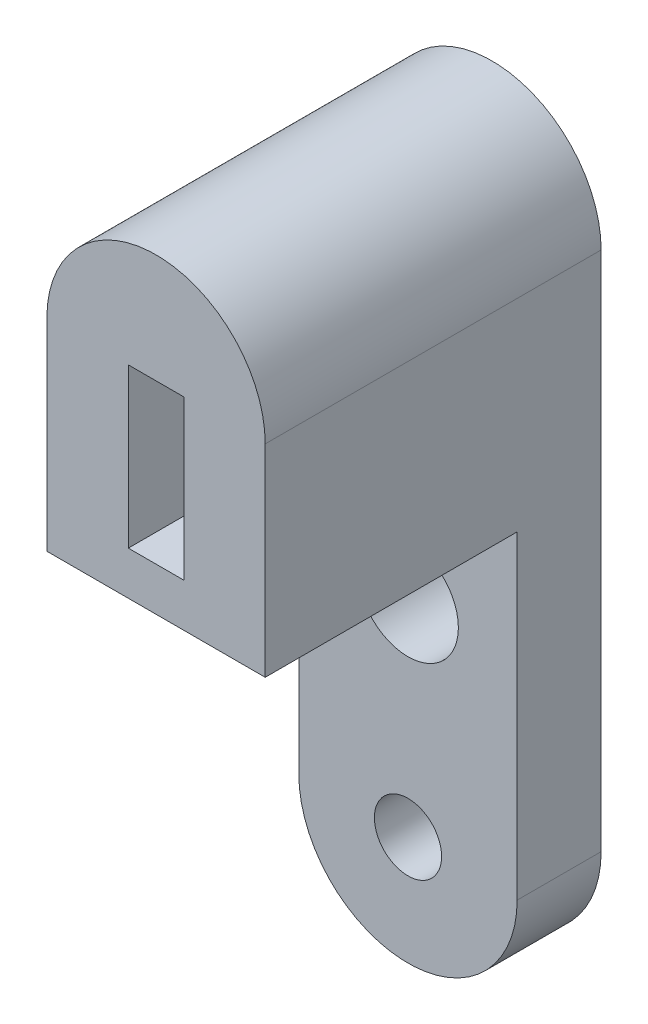
ISO-10303-21;
HEADER;
FILE_DESCRIPTION(('STEP AP214'),'2;1');
FILE_NAME('part.step','',(''),(''),'','','');
FILE_SCHEMA(('AUTOMOTIVE_DESIGN { 1 0 10303 214 1 1 1 1 }'));
ENDSEC;
DATA;
#1=APPLICATION_CONTEXT('core data for automotive mechanical design processes');
#2=APPLICATION_PROTOCOL_DEFINITION('international standard','automotive_design',2000,#1);
#3=PRODUCT_CONTEXT('',#1,'mechanical');
#4=PRODUCT('Part','Part','',(#3));
#5=PRODUCT_RELATED_PRODUCT_CATEGORY('part','',(#4));
#6=PRODUCT_DEFINITION_FORMATION('','',#4);
#7=PRODUCT_DEFINITION_CONTEXT('part definition',#1,'design');
#8=PRODUCT_DEFINITION('design','',#6,#7);
#9=PRODUCT_DEFINITION_SHAPE('','',#8);
#10=(LENGTH_UNIT() NAMED_UNIT(*) SI_UNIT(.MILLI.,.METRE.));
#11=(NAMED_UNIT(*) PLANE_ANGLE_UNIT() SI_UNIT($,.RADIAN.));
#12=(NAMED_UNIT(*) SI_UNIT($,.STERADIAN.) SOLID_ANGLE_UNIT());
#13=UNCERTAINTY_MEASURE_WITH_UNIT(LENGTH_MEASURE(1.E-05),#10,'distance_accuracy_value','');
#14=(GEOMETRIC_REPRESENTATION_CONTEXT(3) GLOBAL_UNCERTAINTY_ASSIGNED_CONTEXT((#13)) GLOBAL_UNIT_ASSIGNED_CONTEXT((#10,
#11,#12)) REPRESENTATION_CONTEXT('',''));
#15=CARTESIAN_POINT('',(0.,0.,0.));
#16=DIRECTION('',(0.,0.,1.));
#17=DIRECTION('',(1.,0.,0.));
#18=AXIS2_PLACEMENT_3D('',#15,#16,#17);
#19=CARTESIAN_POINT('',(0.,0.,5.));
#20=DIRECTION('',(0.,0.,1.));
#21=DIRECTION('',(1.,0.,0.));
#22=AXIS2_PLACEMENT_3D('',#19,#20,#21);
#23=PLANE('',#22);
#24=CARTESIAN_POINT('',(0.,-17.7120700798321,5.));
#25=DIRECTION('',(0.,0.,1.));
#26=DIRECTION('',(1.,0.,0.));
#27=AXIS2_PLACEMENT_3D('',#24,#25,#26);
#28=CIRCLE('',#27,2.);
#29=CARTESIAN_POINT('',(2.,-17.7120700798321,5.));
#30=VERTEX_POINT('',#29);
#31=EDGE_CURVE('E242',#30,#30,#28,.T.);
#32=ORIENTED_EDGE('',*,*,#31,.F.);
#33=EDGE_LOOP('',(#32));
#34=FACE_BOUND('',#33,.T.);
#35=CARTESIAN_POINT('',(0.,-5.41207007983211,5.));
#36=DIRECTION('',(0.,0.,1.));
#37=DIRECTION('',(1.,0.,0.));
#38=AXIS2_PLACEMENT_3D('',#35,#36,#37);
#39=CIRCLE('',#38,2.99999999999997);
#40=CARTESIAN_POINT('',(2.99999999999997,-5.41207007983211,5.));
#41=VERTEX_POINT('',#40);
#42=EDGE_CURVE('E239',#41,#41,#39,.T.);
#43=ORIENTED_EDGE('',*,*,#42,.F.);
#44=EDGE_LOOP('',(#43));
#45=FACE_BOUND('',#44,.T.);
#46=DIRECTION('',(0.,1.,0.));
#47=VECTOR('',#46,1.);
#48=CARTESIAN_POINT('',(6.5,0.,5.));
#49=LINE('',#48,#47);
#50=CARTESIAN_POINT('',(6.5,-17.7120700798321,5.));
#51=VERTEX_POINT('',#50);
#52=CARTESIAN_POINT('',(6.5,1.27632568742796,5.));
#53=VERTEX_POINT('',#52);
#54=EDGE_CURVE('E252',#51,#53,#49,.T.);
#55=ORIENTED_EDGE('',*,*,#54,.T.);
#56=DIRECTION('',(-1.,0.,0.));
#57=VECTOR('',#56,1.);
#58=CARTESIAN_POINT('',(0.,1.27632568742796,5.));
#59=LINE('',#58,#57);
#60=CARTESIAN_POINT('',(-6.5,1.27632568742796,5.));
#61=VERTEX_POINT('',#60);
#62=EDGE_CURVE('E236',#53,#61,#59,.T.);
#63=ORIENTED_EDGE('',*,*,#62,.T.);
#64=DIRECTION('',(0.,1.,0.));
#65=VECTOR('',#64,1.);
#66=CARTESIAN_POINT('',(-6.5,0.,5.));
#67=LINE('',#66,#65);
#68=CARTESIAN_POINT('',(-6.5,-17.7120700798321,5.));
#69=VERTEX_POINT('',#68);
#70=EDGE_CURVE('E246',#69,#61,#67,.T.);
#71=ORIENTED_EDGE('',*,*,#70,.F.);
#72=CARTESIAN_POINT('',(0.,-17.7120700798321,5.));
#73=DIRECTION('',(0.,0.,1.));
#74=DIRECTION('',(1.,0.,0.));
#75=AXIS2_PLACEMENT_3D('',#72,#73,#74);
#76=CIRCLE('',#75,6.5);
#77=EDGE_CURVE('E249',#69,#51,#76,.T.);
#78=ORIENTED_EDGE('',*,*,#77,.T.);
#79=EDGE_LOOP('',(#55,#63,#71,#78));
#80=FACE_BOUND('',#79,.T.);
#81=ADVANCED_FACE('F37',(#34,#45,#80),#23,.T.);
#82=CARTESIAN_POINT('',(1.65,0.,5.));
#83=DIRECTION('',(-1.,0.,0.));
#84=DIRECTION('',(0.,-1.,0.));
#85=AXIS2_PLACEMENT_3D('',#82,#83,#84);
#86=PLANE('',#85);
#87=DIRECTION('',(0.,1.,0.));
#88=VECTOR('',#87,1.);
#89=CARTESIAN_POINT('',(1.65,0.,0.));
#90=LINE('',#89,#88);
#91=CARTESIAN_POINT('',(1.65,3.86292992016788,0.));
#92=VERTEX_POINT('',#91);
#93=CARTESIAN_POINT('',(1.65,13.3129299201679,0.));
#94=VERTEX_POINT('',#93);
#95=EDGE_CURVE('E271',#92,#94,#90,.T.);
#96=ORIENTED_EDGE('',*,*,#95,.F.);
#97=DIRECTION('',(0.,0.,-1.));
#98=VECTOR('',#97,1.);
#99=CARTESIAN_POINT('',(1.65,3.86292992016788,5.));
#100=LINE('',#99,#98);
#101=CARTESIAN_POINT('',(1.65,3.86292992016788,20.));
#102=VERTEX_POINT('',#101);
#103=EDGE_CURVE('E11',#102,#92,#100,.T.);
#104=ORIENTED_EDGE('',*,*,#103,.F.);
#105=DIRECTION('',(0.,1.,0.));
#106=VECTOR('',#105,1.);
#107=CARTESIAN_POINT('',(1.65,0.,20.));
#108=LINE('',#107,#106);
#109=CARTESIAN_POINT('',(1.65,13.3129299201679,20.));
#110=VERTEX_POINT('',#109);
#111=EDGE_CURVE('E202',#102,#110,#108,.T.);
#112=ORIENTED_EDGE('',*,*,#111,.T.);
#113=DIRECTION('',(0.,0.,-1.));
#114=VECTOR('',#113,1.);
#115=CARTESIAN_POINT('',(1.65,13.3129299201679,5.));
#116=LINE('',#115,#114);
#117=EDGE_CURVE('E282',#110,#94,#116,.T.);
#118=ORIENTED_EDGE('',*,*,#117,.T.);
#119=EDGE_LOOP('',(#96,#104,#112,#118));
#120=FACE_BOUND('',#119,.T.);
#121=ADVANCED_FACE('F320',(#120),#86,.T.);
#122=CARTESIAN_POINT('',(0.,3.86292992016788,5.));
#123=DIRECTION('',(0.,1.,0.));
#124=DIRECTION('',(0.,0.,1.));
#125=AXIS2_PLACEMENT_3D('',#122,#123,#124);
#126=PLANE('',#125);
#127=DIRECTION('',(1.,0.,0.));
#128=VECTOR('',#127,1.);
#129=CARTESIAN_POINT('',(0.,3.86292992016788,0.));
#130=LINE('',#129,#128);
#131=CARTESIAN_POINT('',(-1.65,3.86292992016788,0.));
#132=VERTEX_POINT('',#131);
#133=EDGE_CURVE('E274',#132,#92,#130,.T.);
#134=ORIENTED_EDGE('',*,*,#133,.F.);
#135=DIRECTION('',(0.,0.,-1.));
#136=VECTOR('',#135,1.);
#137=CARTESIAN_POINT('',(-1.65,3.86292992016788,5.));
#138=LINE('',#137,#136);
#139=CARTESIAN_POINT('',(-1.65,3.86292992016788,20.));
#140=VERTEX_POINT('',#139);
#141=EDGE_CURVE('E46',#140,#132,#138,.T.);
#142=ORIENTED_EDGE('',*,*,#141,.F.);
#143=DIRECTION('',(1.,0.,0.));
#144=VECTOR('',#143,1.);
#145=CARTESIAN_POINT('',(0.,3.86292992016788,20.));
#146=LINE('',#145,#144);
#147=EDGE_CURVE('E212',#140,#102,#146,.T.);
#148=ORIENTED_EDGE('',*,*,#147,.T.);
#149=ORIENTED_EDGE('',*,*,#103,.T.);
#150=EDGE_LOOP('',(#134,#142,#148,#149));
#151=FACE_BOUND('',#150,.T.);
#152=ADVANCED_FACE('F326',(#151),#126,.T.);
#153=CARTESIAN_POINT('',(-1.65,0.,5.));
#154=DIRECTION('',(-1.,0.,0.));
#155=DIRECTION('',(0.,-1.,0.));
#156=AXIS2_PLACEMENT_3D('',#153,#154,#155);
#157=PLANE('',#156);
#158=CARTESIAN_POINT('',(-1.65,8.58792992016788,10.));
#159=DIRECTION('',(-1.,0.,0.));
#160=DIRECTION('',(0.,-1.,0.));
#161=AXIS2_PLACEMENT_3D('',#158,#159,#160);
#162=CIRCLE('',#161,2.38125);
#163=CARTESIAN_POINT('',(-1.65,6.20667992016788,10.));
#164=VERTEX_POINT('',#163);
#165=EDGE_CURVE('E190',#164,#164,#162,.F.);
#166=ORIENTED_EDGE('',*,*,#165,.F.);
#167=EDGE_LOOP('',(#166));
#168=FACE_BOUND('',#167,.T.);
#169=DIRECTION('',(0.,1.,0.));
#170=VECTOR('',#169,1.);
#171=CARTESIAN_POINT('',(-1.65,0.,0.));
#172=LINE('',#171,#170);
#173=CARTESIAN_POINT('',(-1.65,13.3129299201679,0.));
#174=VERTEX_POINT('',#173);
#175=EDGE_CURVE('E277',#132,#174,#172,.T.);
#176=ORIENTED_EDGE('',*,*,#175,.T.);
#177=DIRECTION('',(0.,0.,-1.));
#178=VECTOR('',#177,1.);
#179=CARTESIAN_POINT('',(-1.65,13.3129299201679,5.));
#180=LINE('',#179,#178);
#181=CARTESIAN_POINT('',(-1.65,13.3129299201679,20.));
#182=VERTEX_POINT('',#181);
#183=EDGE_CURVE('E284',#182,#174,#180,.T.);
#184=ORIENTED_EDGE('',*,*,#183,.F.);
#185=DIRECTION('',(0.,1.,0.));
#186=VECTOR('',#185,1.);
#187=CARTESIAN_POINT('',(-1.65,0.,20.));
#188=LINE('',#187,#186);
#189=EDGE_CURVE('E215',#140,#182,#188,.T.);
#190=ORIENTED_EDGE('',*,*,#189,.F.);
#191=ORIENTED_EDGE('',*,*,#141,.T.);
#192=EDGE_LOOP('',(#176,#184,#190,#191));
#193=FACE_BOUND('',#192,.T.);
#194=ADVANCED_FACE('F340',(#168,#193),#157,.F.);
#195=CARTESIAN_POINT('',(-6.5,0.,5.));
#196=DIRECTION('',(-1.,0.,0.));
#197=DIRECTION('',(0.,0.,1.));
#198=AXIS2_PLACEMENT_3D('',#195,#196,#197);
#199=PLANE('',#198);
#200=DIRECTION('',(0.,0.,1.));
#201=VECTOR('',#200,1.);
#202=CARTESIAN_POINT('',(-6.5,4.46042992016789,7.61698676391981));
#203=LINE('',#202,#201);
#204=CARTESIAN_POINT('',(-6.5,4.46042992016789,7.61698676391981));
#205=VERTEX_POINT('',#204);
#206=CARTESIAN_POINT('',(-6.5,4.46042992016789,12.3830132360802));
#207=VERTEX_POINT('',#206);
#208=EDGE_CURVE('E54',#205,#207,#203,.T.);
#209=ORIENTED_EDGE('',*,*,#208,.F.);
#210=DIRECTION('',(0.,-0.866025403784439,0.5));
#211=VECTOR('',#210,1.);
#212=CARTESIAN_POINT('',(-6.5,8.58792992016789,5.23397352783963));
#213=LINE('',#212,#211);
#214=CARTESIAN_POINT('',(-6.5,8.58792992016789,5.23397352783963));
#215=VERTEX_POINT('',#214);
#216=EDGE_CURVE('E172',#215,#205,#213,.T.);
#217=ORIENTED_EDGE('',*,*,#216,.F.);
#218=DIRECTION('',(0.,-0.866025403784439,-0.5));
#219=VECTOR('',#218,1.);
#220=CARTESIAN_POINT('',(-6.5,12.7154299201679,7.61698676391982));
#221=LINE('',#220,#219);
#222=CARTESIAN_POINT('',(-6.5,12.7154299201679,7.61698676391982));
#223=VERTEX_POINT('',#222);
#224=EDGE_CURVE('E175',#223,#215,#221,.T.);
#225=ORIENTED_EDGE('',*,*,#224,.F.);
#226=DIRECTION('',(0.,0.,-1.));
#227=VECTOR('',#226,1.);
#228=CARTESIAN_POINT('',(-6.5,12.7154299201679,12.3830132360802));
#229=LINE('',#228,#227);
#230=CARTESIAN_POINT('',(-6.5,12.7154299201679,12.3830132360802));
#231=VERTEX_POINT('',#230);
#232=EDGE_CURVE('E195',#231,#223,#229,.T.);
#233=ORIENTED_EDGE('',*,*,#232,.F.);
#234=DIRECTION('',(0.,0.866025403784439,-0.5));
#235=VECTOR('',#234,1.);
#236=CARTESIAN_POINT('',(-6.5,8.58792992016789,14.7660264721604));
#237=LINE('',#236,#235);
#238=CARTESIAN_POINT('',(-6.5,8.58792992016789,14.7660264721604));
#239=VERTEX_POINT('',#238);
#240=EDGE_CURVE('E192',#239,#231,#237,.T.);
#241=ORIENTED_EDGE('',*,*,#240,.F.);
#242=DIRECTION('',(0.,0.866025403784439,0.499999999999999));
#243=VECTOR('',#242,1.);
#244=CARTESIAN_POINT('',(-6.5,4.46042992016789,12.3830132360802));
#245=LINE('',#244,#243);
#246=EDGE_CURVE('E189',#207,#239,#245,.T.);
#247=ORIENTED_EDGE('',*,*,#246,.F.);
#248=EDGE_LOOP('',(#209,#217,#225,#233,#241,#247));
#249=FACE_BOUND('',#248,.T.);
#250=DIRECTION('',(0.,0.,-1.));
#251=VECTOR('',#250,1.);
#252=CARTESIAN_POINT('',(-6.5,13.3129299201679,5.));
#253=LINE('',#252,#251);
#254=CARTESIAN_POINT('',(-6.5,13.3129299201679,20.));
#255=VERTEX_POINT('',#254);
#256=CARTESIAN_POINT('',(-6.5,13.3129299201679,0.));
#257=VERTEX_POINT('',#256);
#258=EDGE_CURVE('E255',#255,#257,#253,.T.);
#259=ORIENTED_EDGE('',*,*,#258,.T.);
#260=DIRECTION('',(0.,1.,0.));
#261=VECTOR('',#260,1.);
#262=CARTESIAN_POINT('',(-6.5,0.,0.));
#263=LINE('',#262,#261);
#264=CARTESIAN_POINT('',(-6.5,-17.7120700798321,0.));
#265=VERTEX_POINT('',#264);
#266=EDGE_CURVE('E261',#265,#257,#263,.T.);
#267=ORIENTED_EDGE('',*,*,#266,.F.);
#268=DIRECTION('',(0.,0.,-1.));
#269=VECTOR('',#268,1.);
#270=CARTESIAN_POINT('',(-6.5,-17.7120700798321,5.));
#271=LINE('',#270,#269);
#272=EDGE_CURVE('E41',#69,#265,#271,.T.);
#273=ORIENTED_EDGE('',*,*,#272,.F.);
#274=ORIENTED_EDGE('',*,*,#70,.T.);
#275=DIRECTION('',(0.,0.,-1.));
#276=VECTOR('',#275,1.);
#277=CARTESIAN_POINT('',(-6.5,1.27632568742796,20.));
#278=LINE('',#277,#276);
#279=CARTESIAN_POINT('',(-6.5,1.27632568742796,20.));
#280=VERTEX_POINT('',#279);
#281=EDGE_CURVE('E62',#280,#61,#278,.T.);
#282=ORIENTED_EDGE('',*,*,#281,.F.);
#283=DIRECTION('',(0.,1.,0.));
#284=VECTOR('',#283,1.);
#285=CARTESIAN_POINT('',(-6.5,0.,20.));
#286=LINE('',#285,#284);
#287=EDGE_CURVE('E227',#280,#255,#286,.T.);
#288=ORIENTED_EDGE('',*,*,#287,.T.);
#289=EDGE_LOOP('',(#259,#267,#273,#274,#282,#288));
#290=FACE_BOUND('',#289,.T.);
#291=ADVANCED_FACE('F307',(#249,#290),#199,.T.);
#292=CARTESIAN_POINT('',(0.,-17.7120700798321,5.));
#293=DIRECTION('',(0.,0.,-1.));
#294=DIRECTION('',(-1.,0.,0.));
#295=AXIS2_PLACEMENT_3D('',#292,#293,#294);
#296=CYLINDRICAL_SURFACE('',#295,6.5);
#297=CARTESIAN_POINT('',(0.,-17.7120700798321,0.));
#298=DIRECTION('',(0.,0.,1.));
#299=DIRECTION('',(1.,0.,0.));
#300=AXIS2_PLACEMENT_3D('',#297,#298,#299);
#301=CIRCLE('',#300,6.5);
#302=CARTESIAN_POINT('',(6.5,-17.7120700798321,0.));
#303=VERTEX_POINT('',#302);
#304=EDGE_CURVE('E263',#265,#303,#301,.T.);
#305=ORIENTED_EDGE('',*,*,#304,.T.);
#306=DIRECTION('',(0.,0.,-1.));
#307=VECTOR('',#306,1.);
#308=CARTESIAN_POINT('',(6.5,-17.7120700798321,5.));
#309=LINE('',#308,#307);
#310=EDGE_CURVE('E292',#51,#303,#309,.T.);
#311=ORIENTED_EDGE('',*,*,#310,.F.);
#312=ORIENTED_EDGE('',*,*,#77,.F.);
#313=ORIENTED_EDGE('',*,*,#272,.T.);
#314=EDGE_LOOP('',(#305,#311,#312,#313));
#315=FACE_BOUND('',#314,.T.);
#316=ADVANCED_FACE('F299',(#315),#296,.T.);
#317=CARTESIAN_POINT('',(6.5,0.,5.));
#318=DIRECTION('',(-1.,0.,0.));
#319=DIRECTION('',(0.,0.,1.));
#320=AXIS2_PLACEMENT_3D('',#317,#318,#319);
#321=PLANE('',#320);
#322=DIRECTION('',(0.,0.,-1.));
#323=VECTOR('',#322,1.);
#324=CARTESIAN_POINT('',(6.5,13.3129299201679,5.));
#325=LINE('',#324,#323);
#326=CARTESIAN_POINT('',(6.5,13.3129299201679,20.));
#327=VERTEX_POINT('',#326);
#328=CARTESIAN_POINT('',(6.5,13.3129299201679,0.));
#329=VERTEX_POINT('',#328);
#330=EDGE_CURVE('E290',#327,#329,#325,.T.);
#331=ORIENTED_EDGE('',*,*,#330,.F.);
#332=DIRECTION('',(0.,1.,0.));
#333=VECTOR('',#332,1.);
#334=CARTESIAN_POINT('',(6.5,0.,20.));
#335=LINE('',#334,#333);
#336=CARTESIAN_POINT('',(6.5,1.27632568742796,20.));
#337=VERTEX_POINT('',#336);
#338=EDGE_CURVE('E221',#337,#327,#335,.T.);
#339=ORIENTED_EDGE('',*,*,#338,.F.);
#340=DIRECTION('',(0.,0.,-1.));
#341=VECTOR('',#340,1.);
#342=CARTESIAN_POINT('',(6.5,1.27632568742796,20.));
#343=LINE('',#342,#341);
#344=EDGE_CURVE('E232',#337,#53,#343,.T.);
#345=ORIENTED_EDGE('',*,*,#344,.T.);
#346=ORIENTED_EDGE('',*,*,#54,.F.);
#347=ORIENTED_EDGE('',*,*,#310,.T.);
#348=DIRECTION('',(0.,1.,0.));
#349=VECTOR('',#348,1.);
#350=CARTESIAN_POINT('',(6.5,0.,0.));
#351=LINE('',#350,#349);
#352=EDGE_CURVE('E266',#303,#329,#351,.T.);
#353=ORIENTED_EDGE('',*,*,#352,.T.);
#354=EDGE_LOOP('',(#331,#339,#345,#346,#347,#353));
#355=FACE_BOUND('',#354,.T.);
#356=ADVANCED_FACE('F313',(#355),#321,.F.);
#357=CARTESIAN_POINT('',(0.,13.3129299201679,5.));
#358=DIRECTION('',(0.,0.,-1.));
#359=DIRECTION('',(-1.,0.,0.));
#360=AXIS2_PLACEMENT_3D('',#357,#358,#359);
#361=CYLINDRICAL_SURFACE('',#360,6.5);
#362=CARTESIAN_POINT('',(0.,13.3129299201679,0.));
#363=DIRECTION('',(0.,0.,1.));
#364=DIRECTION('',(1.,0.,0.));
#365=AXIS2_PLACEMENT_3D('',#362,#363,#364);
#366=CIRCLE('',#365,6.5);
#367=EDGE_CURVE('E268',#329,#257,#366,.T.);
#368=ORIENTED_EDGE('',*,*,#367,.T.);
#369=ORIENTED_EDGE('',*,*,#258,.F.);
#370=CARTESIAN_POINT('',(0.,13.3129299201679,20.));
#371=DIRECTION('',(0.,0.,1.));
#372=DIRECTION('',(1.,0.,0.));
#373=AXIS2_PLACEMENT_3D('',#370,#371,#372);
#374=CIRCLE('',#373,6.5);
#375=EDGE_CURVE('E224',#327,#255,#374,.T.);
#376=ORIENTED_EDGE('',*,*,#375,.F.);
#377=ORIENTED_EDGE('',*,*,#330,.T.);
#378=EDGE_LOOP('',(#368,#369,#376,#377));
#379=FACE_BOUND('',#378,.T.);
#380=ADVANCED_FACE('F311',(#379),#361,.T.);
#381=CARTESIAN_POINT('',(0.,-17.7120700798321,5.));
#382=DIRECTION('',(0.,0.,-1.));
#383=DIRECTION('',(-1.,0.,0.));
#384=AXIS2_PLACEMENT_3D('',#381,#382,#383);
#385=CYLINDRICAL_SURFACE('',#384,2.);
#386=ORIENTED_EDGE('',*,*,#31,.T.);
#387=EDGE_LOOP('',(#386));
#388=FACE_BOUND('',#387,.T.);
#389=CARTESIAN_POINT('',(0.,-17.7120700798321,0.));
#390=DIRECTION('',(0.,0.,1.));
#391=DIRECTION('',(1.,0.,0.));
#392=AXIS2_PLACEMENT_3D('',#389,#390,#391);
#393=CIRCLE('',#392,2.);
#394=CARTESIAN_POINT('',(2.,-17.7120700798321,0.));
#395=VERTEX_POINT('',#394);
#396=EDGE_CURVE('E258',#395,#395,#393,.T.);
#397=ORIENTED_EDGE('',*,*,#396,.F.);
#398=EDGE_LOOP('',(#397));
#399=FACE_BOUND('',#398,.T.);
#400=ADVANCED_FACE('F349',(#388,#399),#385,.F.);
#401=CARTESIAN_POINT('',(0.,-5.41207007983211,5.));
#402=DIRECTION('',(0.,0.,-1.));
#403=DIRECTION('',(-1.,0.,0.));
#404=AXIS2_PLACEMENT_3D('',#401,#402,#403);
#405=CYLINDRICAL_SURFACE('',#404,2.99999999999997);
#406=ORIENTED_EDGE('',*,*,#42,.T.);
#407=EDGE_LOOP('',(#406));
#408=FACE_BOUND('',#407,.T.);
#409=CARTESIAN_POINT('',(0.,-5.41207007983211,0.));
#410=DIRECTION('',(0.,0.,1.));
#411=DIRECTION('',(1.,0.,0.));
#412=AXIS2_PLACEMENT_3D('',#409,#410,#411);
#413=CIRCLE('',#412,2.99999999999997);
#414=CARTESIAN_POINT('',(2.99999999999997,-5.41207007983211,0.));
#415=VERTEX_POINT('',#414);
#416=EDGE_CURVE('E238',#415,#415,#413,.T.);
#417=ORIENTED_EDGE('',*,*,#416,.F.);
#418=EDGE_LOOP('',(#417));
#419=FACE_BOUND('',#418,.T.);
#420=ADVANCED_FACE('F39',(#408,#419),#405,.F.);
#421=CARTESIAN_POINT('',(0.,13.3129299201679,5.));
#422=DIRECTION('',(0.,1.,0.));
#423=DIRECTION('',(0.,0.,1.));
#424=AXIS2_PLACEMENT_3D('',#421,#422,#423);
#425=PLANE('',#424);
#426=DIRECTION('',(1.,0.,0.));
#427=VECTOR('',#426,1.);
#428=CARTESIAN_POINT('',(0.,13.3129299201679,0.));
#429=LINE('',#428,#427);
#430=EDGE_CURVE('E243',#174,#94,#429,.T.);
#431=ORIENTED_EDGE('',*,*,#430,.T.);
#432=ORIENTED_EDGE('',*,*,#117,.F.);
#433=DIRECTION('',(1.,0.,0.));
#434=VECTOR('',#433,1.);
#435=CARTESIAN_POINT('',(0.,13.3129299201679,20.));
#436=LINE('',#435,#434);
#437=EDGE_CURVE('E218',#182,#110,#436,.T.);
#438=ORIENTED_EDGE('',*,*,#437,.F.);
#439=ORIENTED_EDGE('',*,*,#183,.T.);
#440=EDGE_LOOP('',(#431,#432,#438,#439));
#441=FACE_BOUND('',#440,.T.);
#442=ADVANCED_FACE('F336',(#441),#425,.F.);
#443=CARTESIAN_POINT('',(0.,0.,0.));
#444=DIRECTION('',(0.,0.,1.));
#445=DIRECTION('',(1.,0.,0.));
#446=AXIS2_PLACEMENT_3D('',#443,#444,#445);
#447=PLANE('',#446);
#448=ORIENTED_EDGE('',*,*,#367,.F.);
#449=ORIENTED_EDGE('',*,*,#352,.F.);
#450=ORIENTED_EDGE('',*,*,#304,.F.);
#451=ORIENTED_EDGE('',*,*,#266,.T.);
#452=EDGE_LOOP('',(#448,#449,#450,#451));
#453=FACE_BOUND('',#452,.T.);
#454=ORIENTED_EDGE('',*,*,#95,.T.);
#455=ORIENTED_EDGE('',*,*,#430,.F.);
#456=ORIENTED_EDGE('',*,*,#175,.F.);
#457=ORIENTED_EDGE('',*,*,#133,.T.);
#458=EDGE_LOOP('',(#454,#455,#456,#457));
#459=FACE_BOUND('',#458,.T.);
#460=ORIENTED_EDGE('',*,*,#396,.T.);
#461=EDGE_LOOP('',(#460));
#462=FACE_BOUND('',#461,.T.);
#463=ORIENTED_EDGE('',*,*,#416,.T.);
#464=EDGE_LOOP('',(#463));
#465=FACE_BOUND('',#464,.T.);
#466=ADVANCED_FACE('F305',(#453,#459,#462,#465),#447,.F.);
#467=CARTESIAN_POINT('',(0.,1.27632568742796,20.));
#468=DIRECTION('',(0.,1.,0.));
#469=DIRECTION('',(0.,0.,1.));
#470=AXIS2_PLACEMENT_3D('',#467,#468,#469);
#471=PLANE('',#470);
#472=ORIENTED_EDGE('',*,*,#62,.F.);
#473=ORIENTED_EDGE('',*,*,#344,.F.);
#474=DIRECTION('',(1.,0.,0.));
#475=VECTOR('',#474,1.);
#476=CARTESIAN_POINT('',(0.,1.27632568742796,20.));
#477=LINE('',#476,#475);
#478=EDGE_CURVE('E230',#280,#337,#477,.T.);
#479=ORIENTED_EDGE('',*,*,#478,.F.);
#480=ORIENTED_EDGE('',*,*,#281,.T.);
#481=EDGE_LOOP('',(#472,#473,#479,#480));
#482=FACE_BOUND('',#481,.T.);
#483=ADVANCED_FACE('F317',(#482),#471,.F.);
#484=CARTESIAN_POINT('',(0.,0.,20.));
#485=DIRECTION('',(0.,0.,1.));
#486=DIRECTION('',(1.,0.,0.));
#487=AXIS2_PLACEMENT_3D('',#484,#485,#486);
#488=PLANE('',#487);
#489=ORIENTED_EDGE('',*,*,#111,.F.);
#490=ORIENTED_EDGE('',*,*,#147,.F.);
#491=ORIENTED_EDGE('',*,*,#189,.T.);
#492=ORIENTED_EDGE('',*,*,#437,.T.);
#493=EDGE_LOOP('',(#489,#490,#491,#492));
#494=FACE_BOUND('',#493,.T.);
#495=ORIENTED_EDGE('',*,*,#338,.T.);
#496=ORIENTED_EDGE('',*,*,#375,.T.);
#497=ORIENTED_EDGE('',*,*,#287,.F.);
#498=ORIENTED_EDGE('',*,*,#478,.T.);
#499=EDGE_LOOP('',(#495,#496,#497,#498));
#500=FACE_BOUND('',#499,.T.);
#501=ADVANCED_FACE('F316',(#494,#500),#488,.T.);
#502=CARTESIAN_POINT('',(-3.325,4.46042992016789,7.61698676391981));
#503=DIRECTION('',(0.,-1.,0.));
#504=DIRECTION('',(0.,0.,-1.));
#505=AXIS2_PLACEMENT_3D('',#502,#503,#504);
#506=PLANE('',#505);
#507=ORIENTED_EDGE('',*,*,#208,.T.);
#508=DIRECTION('',(-1.,0.,0.));
#509=VECTOR('',#508,1.);
#510=CARTESIAN_POINT('',(-3.325,4.46042992016789,12.3830132360802));
#511=LINE('',#510,#509);
#512=CARTESIAN_POINT('',(-3.325,4.46042992016789,12.3830132360802));
#513=VERTEX_POINT('',#512);
#514=EDGE_CURVE('E149',#513,#207,#511,.T.);
#515=ORIENTED_EDGE('',*,*,#514,.F.);
#516=DIRECTION('',(0.,0.,1.));
#517=VECTOR('',#516,1.);
#518=CARTESIAN_POINT('',(-3.325,4.46042992016789,7.61698676391981));
#519=LINE('',#518,#517);
#520=CARTESIAN_POINT('',(-3.325,4.46042992016789,7.61698676391981));
#521=VERTEX_POINT('',#520);
#522=EDGE_CURVE('E153',#521,#513,#519,.T.);
#523=ORIENTED_EDGE('',*,*,#522,.F.);
#524=DIRECTION('',(-1.,0.,0.));
#525=VECTOR('',#524,1.);
#526=CARTESIAN_POINT('',(-3.325,4.46042992016789,7.61698676391981));
#527=LINE('',#526,#525);
#528=EDGE_CURVE('E200',#521,#205,#527,.T.);
#529=ORIENTED_EDGE('',*,*,#528,.T.);
#530=EDGE_LOOP('',(#507,#515,#523,#529));
#531=FACE_BOUND('',#530,.T.);
#532=ADVANCED_FACE('F151',(#531),#506,.F.);
#533=CARTESIAN_POINT('',(-3.325,8.58792992016789,5.23397352783963));
#534=DIRECTION('',(0.,-0.5,-0.866025403784439));
#535=DIRECTION('',(0.,0.866025403784439,-0.5));
#536=AXIS2_PLACEMENT_3D('',#533,#534,#535);
#537=PLANE('',#536);
#538=ORIENTED_EDGE('',*,*,#216,.T.);
#539=ORIENTED_EDGE('',*,*,#528,.F.);
#540=DIRECTION('',(0.,-0.866025403784439,0.5));
#541=VECTOR('',#540,1.);
#542=CARTESIAN_POINT('',(-3.325,8.58792992016789,5.23397352783963));
#543=LINE('',#542,#541);
#544=CARTESIAN_POINT('',(-3.325,8.58792992016789,5.23397352783963));
#545=VERTEX_POINT('',#544);
#546=EDGE_CURVE('E159',#545,#521,#543,.T.);
#547=ORIENTED_EDGE('',*,*,#546,.F.);
#548=DIRECTION('',(-1.,0.,0.));
#549=VECTOR('',#548,1.);
#550=CARTESIAN_POINT('',(-3.325,8.58792992016789,5.23397352783963));
#551=LINE('',#550,#549);
#552=EDGE_CURVE('E203',#545,#215,#551,.T.);
#553=ORIENTED_EDGE('',*,*,#552,.T.);
#554=EDGE_LOOP('',(#538,#539,#547,#553));
#555=FACE_BOUND('',#554,.T.);
#556=ADVANCED_FACE('F398',(#555),#537,.F.);
#557=CARTESIAN_POINT('',(-3.325,12.7154299201679,7.61698676391982));
#558=DIRECTION('',(0.,0.5,-0.866025403784439));
#559=DIRECTION('',(0.,0.866025403784439,0.5));
#560=AXIS2_PLACEMENT_3D('',#557,#558,#559);
#561=PLANE('',#560);
#562=ORIENTED_EDGE('',*,*,#224,.T.);
#563=ORIENTED_EDGE('',*,*,#552,.F.);
#564=DIRECTION('',(0.,-0.866025403784439,-0.5));
#565=VECTOR('',#564,1.);
#566=CARTESIAN_POINT('',(-3.325,12.7154299201679,7.61698676391982));
#567=LINE('',#566,#565);
#568=CARTESIAN_POINT('',(-3.325,12.7154299201679,7.61698676391982));
#569=VERTEX_POINT('',#568);
#570=EDGE_CURVE('E185',#569,#545,#567,.T.);
#571=ORIENTED_EDGE('',*,*,#570,.F.);
#572=DIRECTION('',(-1.,0.,0.));
#573=VECTOR('',#572,1.);
#574=CARTESIAN_POINT('',(-3.325,12.7154299201679,7.61698676391982));
#575=LINE('',#574,#573);
#576=EDGE_CURVE('E205',#569,#223,#575,.T.);
#577=ORIENTED_EDGE('',*,*,#576,.T.);
#578=EDGE_LOOP('',(#562,#563,#571,#577));
#579=FACE_BOUND('',#578,.T.);
#580=ADVANCED_FACE('F405',(#579),#561,.F.);
#581=CARTESIAN_POINT('',(-3.325,12.7154299201679,12.3830132360802));
#582=DIRECTION('',(0.,1.,0.));
#583=DIRECTION('',(0.,0.,1.));
#584=AXIS2_PLACEMENT_3D('',#581,#582,#583);
#585=PLANE('',#584);
#586=ORIENTED_EDGE('',*,*,#232,.T.);
#587=ORIENTED_EDGE('',*,*,#576,.F.);
#588=DIRECTION('',(0.,0.,-1.));
#589=VECTOR('',#588,1.);
#590=CARTESIAN_POINT('',(-3.325,12.7154299201679,12.3830132360802));
#591=LINE('',#590,#589);
#592=CARTESIAN_POINT('',(-3.325,12.7154299201679,12.3830132360802));
#593=VERTEX_POINT('',#592);
#594=EDGE_CURVE('E182',#593,#569,#591,.T.);
#595=ORIENTED_EDGE('',*,*,#594,.F.);
#596=DIRECTION('',(-1.,0.,0.));
#597=VECTOR('',#596,1.);
#598=CARTESIAN_POINT('',(-3.325,12.7154299201679,12.3830132360802));
#599=LINE('',#598,#597);
#600=EDGE_CURVE('E207',#593,#231,#599,.T.);
#601=ORIENTED_EDGE('',*,*,#600,.T.);
#602=EDGE_LOOP('',(#586,#587,#595,#601));
#603=FACE_BOUND('',#602,.T.);
#604=ADVANCED_FACE('F413',(#603),#585,.F.);
#605=CARTESIAN_POINT('',(-3.325,8.58792992016789,14.7660264721604));
#606=DIRECTION('',(0.,0.5,0.866025403784439));
#607=DIRECTION('',(0.,-0.866025403784439,0.5));
#608=AXIS2_PLACEMENT_3D('',#605,#606,#607);
#609=PLANE('',#608);
#610=ORIENTED_EDGE('',*,*,#240,.T.);
#611=ORIENTED_EDGE('',*,*,#600,.F.);
#612=DIRECTION('',(0.,0.866025403784439,-0.5));
#613=VECTOR('',#612,1.);
#614=CARTESIAN_POINT('',(-3.325,8.58792992016789,14.7660264721604));
#615=LINE('',#614,#613);
#616=CARTESIAN_POINT('',(-3.325,8.58792992016789,14.7660264721604));
#617=VERTEX_POINT('',#616);
#618=EDGE_CURVE('E167',#617,#593,#615,.T.);
#619=ORIENTED_EDGE('',*,*,#618,.F.);
#620=DIRECTION('',(-1.,0.,0.));
#621=VECTOR('',#620,1.);
#622=CARTESIAN_POINT('',(-3.325,8.58792992016789,14.7660264721604));
#623=LINE('',#622,#621);
#624=EDGE_CURVE('E158',#617,#239,#623,.T.);
#625=ORIENTED_EDGE('',*,*,#624,.T.);
#626=EDGE_LOOP('',(#610,#611,#619,#625));
#627=FACE_BOUND('',#626,.T.);
#628=ADVANCED_FACE('F421',(#627),#609,.F.);
#629=CARTESIAN_POINT('',(-3.325,4.46042992016789,12.3830132360802));
#630=DIRECTION('',(0.,-0.499999999999999,0.866025403784439));
#631=DIRECTION('',(0.,-0.866025403784439,-0.499999999999999));
#632=AXIS2_PLACEMENT_3D('',#629,#630,#631);
#633=PLANE('',#632);
#634=ORIENTED_EDGE('',*,*,#246,.T.);
#635=ORIENTED_EDGE('',*,*,#624,.F.);
#636=DIRECTION('',(0.,0.866025403784439,0.499999999999999));
#637=VECTOR('',#636,1.);
#638=CARTESIAN_POINT('',(-3.325,4.46042992016789,12.3830132360802));
#639=LINE('',#638,#637);
#640=EDGE_CURVE('E162',#513,#617,#639,.T.);
#641=ORIENTED_EDGE('',*,*,#640,.F.);
#642=ORIENTED_EDGE('',*,*,#514,.T.);
#643=EDGE_LOOP('',(#634,#635,#641,#642));
#644=FACE_BOUND('',#643,.T.);
#645=ADVANCED_FACE('F163',(#644),#633,.F.);
#646=CARTESIAN_POINT('',(-3.325,0.,0.));
#647=DIRECTION('',(-1.,0.,0.));
#648=DIRECTION('',(0.,0.,1.));
#649=AXIS2_PLACEMENT_3D('',#646,#647,#648);
#650=PLANE('',#649);
#651=CARTESIAN_POINT('',(-3.325,8.58792992016788,10.));
#652=DIRECTION('',(-1.,0.,0.));
#653=DIRECTION('',(0.,0.,1.));
#654=AXIS2_PLACEMENT_3D('',#651,#652,#653);
#655=CIRCLE('',#654,2.38125);
#656=CARTESIAN_POINT('',(-3.325,8.58792992016788,12.38125));
#657=VERTEX_POINT('',#656);
#658=EDGE_CURVE('E178',#657,#657,#655,.F.);
#659=ORIENTED_EDGE('',*,*,#658,.T.);
#660=EDGE_LOOP('',(#659));
#661=FACE_BOUND('',#660,.T.);
#662=ORIENTED_EDGE('',*,*,#522,.T.);
#663=ORIENTED_EDGE('',*,*,#640,.T.);
#664=ORIENTED_EDGE('',*,*,#618,.T.);
#665=ORIENTED_EDGE('',*,*,#594,.T.);
#666=ORIENTED_EDGE('',*,*,#570,.T.);
#667=ORIENTED_EDGE('',*,*,#546,.T.);
#668=EDGE_LOOP('',(#662,#663,#664,#665,#666,#667));
#669=FACE_BOUND('',#668,.T.);
#670=ADVANCED_FACE('F169',(#661,#669),#650,.T.);
#671=CARTESIAN_POINT('',(6.501,8.58792992016788,10.));
#672=DIRECTION('',(-1.,0.,0.));
#673=DIRECTION('',(0.,0.,1.));
#674=AXIS2_PLACEMENT_3D('',#671,#672,#673);
#675=CYLINDRICAL_SURFACE('',#674,2.38125);
#676=ORIENTED_EDGE('',*,*,#658,.F.);
#677=EDGE_LOOP('',(#676));
#678=FACE_BOUND('',#677,.T.);
#679=ORIENTED_EDGE('',*,*,#165,.T.);
#680=EDGE_LOOP('',(#679));
#681=FACE_BOUND('',#680,.T.);
#682=ADVANCED_FACE('F443',(#678,#681),#675,.F.);
#683=CLOSED_SHELL('',(#81,#121,#152,#194,#291,#316,#356,#380,#400,#420,#442,#466,#483,#501,#532,
#556,#580,#604,#628,#645,#670,#682));
#684=MANIFOLD_SOLID_BREP('B2',#683);
#685=ADVANCED_BREP_SHAPE_REPRESENTATION('',(#18,#684),#14);
#686=SHAPE_DEFINITION_REPRESENTATION(#9,#685);
ENDSEC;
END-ISO-10303-21;
